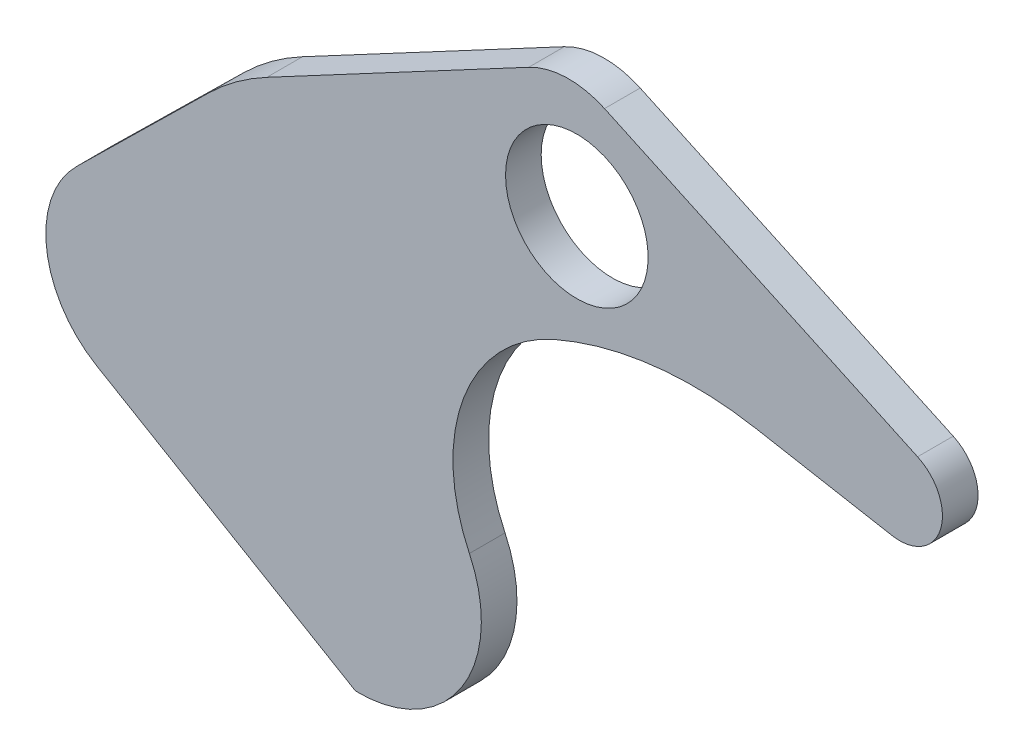
ISO-10303-21;
HEADER;
FILE_DESCRIPTION(('STEP AP214'),'2;1');
FILE_NAME('part.step','',(''),(''),'','','');
FILE_SCHEMA(('AUTOMOTIVE_DESIGN { 1 0 10303 214 1 1 1 1 }'));
ENDSEC;
DATA;
#1=APPLICATION_CONTEXT('core data for automotive mechanical design processes');
#2=APPLICATION_PROTOCOL_DEFINITION('international standard','automotive_design',2000,#1);
#3=PRODUCT_CONTEXT('',#1,'mechanical');
#4=PRODUCT('Part','Part','',(#3));
#5=PRODUCT_RELATED_PRODUCT_CATEGORY('part','',(#4));
#6=PRODUCT_DEFINITION_FORMATION('','',#4);
#7=PRODUCT_DEFINITION_CONTEXT('part definition',#1,'design');
#8=PRODUCT_DEFINITION('design','',#6,#7);
#9=PRODUCT_DEFINITION_SHAPE('','',#8);
#10=(LENGTH_UNIT() NAMED_UNIT(*) SI_UNIT(.MILLI.,.METRE.));
#11=(NAMED_UNIT(*) PLANE_ANGLE_UNIT() SI_UNIT($,.RADIAN.));
#12=(NAMED_UNIT(*) SI_UNIT($,.STERADIAN.) SOLID_ANGLE_UNIT());
#13=UNCERTAINTY_MEASURE_WITH_UNIT(LENGTH_MEASURE(1.E-05),#10,'distance_accuracy_value','');
#14=(GEOMETRIC_REPRESENTATION_CONTEXT(3) GLOBAL_UNCERTAINTY_ASSIGNED_CONTEXT((#13)) GLOBAL_UNIT_ASSIGNED_CONTEXT((#10,
#11,#12)) REPRESENTATION_CONTEXT('',''));
#15=CARTESIAN_POINT('',(0.,0.,0.));
#16=DIRECTION('',(0.,0.,1.));
#17=DIRECTION('',(1.,0.,0.));
#18=AXIS2_PLACEMENT_3D('',#15,#16,#17);
#19=CARTESIAN_POINT('',(-15.0507953187441,63.2742008184103,2.12075049396742));
#20=DIRECTION('',(0.,0.,1.));
#21=DIRECTION('',(1.,0.,0.));
#22=AXIS2_PLACEMENT_3D('',#19,#20,#21);
#23=PLANE('',#22);
#24=CARTESIAN_POINT('',(-15.0507953187441,63.2742008184103,2.12075049396742));
#25=DIRECTION('',(0.,0.,-1.));
#26=DIRECTION('',(-1.,0.,0.));
#27=AXIS2_PLACEMENT_3D('',#24,#25,#26);
#28=CIRCLE('',#27,0.244);
#29=CARTESIAN_POINT('',(-15.2947953187441,63.2742008184103,2.12075049396742));
#30=VERTEX_POINT('',#29);
#31=EDGE_CURVE('E40',#30,#30,#28,.F.);
#32=ORIENTED_EDGE('',*,*,#31,.F.);
#33=EDGE_LOOP('',(#32));
#34=FACE_BOUND('',#33,.T.);
#35=ADVANCED_FACE('F37',(#34),#23,.F.);
#36=CARTESIAN_POINT('',(-15.0507953187441,63.2742008184103,2.60875049396742));
#37=DIRECTION('',(0.,0.,-1.));
#38=DIRECTION('',(-1.,0.,0.));
#39=AXIS2_PLACEMENT_3D('',#36,#37,#38);
#40=CYLINDRICAL_SURFACE('',#39,0.244);
#41=CARTESIAN_POINT('',(-15.0507953187441,63.2742008184103,2.36475049396742));
#42=DIRECTION('',(0.,0.,-1.));
#43=DIRECTION('',(-1.,0.,0.));
#44=AXIS2_PLACEMENT_3D('',#41,#42,#43);
#45=CIRCLE('',#44,0.244);
#46=CARTESIAN_POINT('',(-15.2947953187441,63.2742008184103,2.36475049396742));
#47=VERTEX_POINT('',#46);
#48=EDGE_CURVE('E136',#47,#47,#45,.F.);
#49=ORIENTED_EDGE('',*,*,#48,.F.);
#50=EDGE_LOOP('',(#49));
#51=FACE_BOUND('',#50,.T.);
#52=ORIENTED_EDGE('',*,*,#31,.T.);
#53=EDGE_LOOP('',(#52));
#54=FACE_BOUND('',#53,.T.);
#55=ADVANCED_FACE('F215',(#51,#54),#40,.T.);
#56=CARTESIAN_POINT('',(-12.8619279288401,64.0390431083175,2.36475049396742));
#57=DIRECTION('',(0.,0.,-1.));
#58=DIRECTION('',(-1.,0.,0.));
#59=AXIS2_PLACEMENT_3D('',#56,#57,#58);
#60=PLANE('',#59);
#61=CARTESIAN_POINT('',(-12.1262589596433,65.1716124143208,2.36475049396742));
#62=DIRECTION('',(0.,0.,-1.));
#63=DIRECTION('',(-1.,0.,0.));
#64=AXIS2_PLACEMENT_3D('',#61,#62,#63);
#65=CIRCLE('',#64,0.488);
#66=CARTESIAN_POINT('',(-12.6142589596433,65.1716124143208,2.36475049396742));
#67=VERTEX_POINT('',#66);
#68=EDGE_CURVE('E152',#67,#67,#65,.F.);
#69=ORIENTED_EDGE('',*,*,#68,.T.);
#70=EDGE_LOOP('',(#69));
#71=FACE_BOUND('',#70,.T.);
#72=ORIENTED_EDGE('',*,*,#48,.T.);
#73=EDGE_LOOP('',(#72));
#74=FACE_BOUND('',#73,.T.);
#75=CARTESIAN_POINT('',(-13.4315915398064,63.4030464994757,2.36475049396742));
#76=DIRECTION('',(0.,0.,-1.));
#77=DIRECTION('',(-1.,0.,0.));
#78=AXIS2_PLACEMENT_3D('',#75,#76,#77);
#79=CIRCLE('',#78,1.73594301707969);
#80=CARTESIAN_POINT('',(-14.2483439210238,64.9348473045164,2.36475049396742));
#81=VERTEX_POINT('',#80);
#82=CARTESIAN_POINT('',(-14.6478616043926,64.641668834385,2.36475049396742));
#83=VERTEX_POINT('',#82);
#84=EDGE_CURVE('E192',#81,#83,#79,.F.);
#85=ORIENTED_EDGE('',*,*,#84,.F.);
#86=DIRECTION('',(-0.88240269984081,-0.470494925917006,0.));
#87=VECTOR('',#86,1.);
#88=CARTESIAN_POINT('',(-13.3520322219305,65.4127584742573,2.36475049396742));
#89=LINE('',#88,#87);
#90=CARTESIAN_POINT('',(-12.455720522838,65.8906696439978,2.36475049396742));
#91=VERTEX_POINT('',#90);
#92=EDGE_CURVE('E130',#91,#81,#89,.T.);
#93=ORIENTED_EDGE('',*,*,#92,.F.);
#94=CARTESIAN_POINT('',(-12.1816052253119,65.376572540542,2.36475049396742));
#95=DIRECTION('',(0.,0.,-1.));
#96=DIRECTION('',(-1.,0.,0.));
#97=AXIS2_PLACEMENT_3D('',#94,#95,#96);
#98=CIRCLE('',#97,0.582610528671788);
#99=CARTESIAN_POINT('',(-11.936749119351,65.905231708145,2.36475049396742));
#100=VERTEX_POINT('',#99);
#101=EDGE_CURVE('E125',#100,#91,#98,.F.);
#102=ORIENTED_EDGE('',*,*,#101,.F.);
#103=DIRECTION('',(-0.90739720892107,0.420274083476786,0.));
#104=VECTOR('',#103,1.);
#105=CARTESIAN_POINT('',(-10.8653298007544,65.4089884227177,2.36475049396742));
#106=LINE('',#105,#104);
#107=CARTESIAN_POINT('',(-9.79391048215854,64.9127451372913,2.36475049396742));
#108=VERTEX_POINT('',#107);
#109=EDGE_CURVE('E128',#108,#100,#106,.T.);
#110=ORIENTED_EDGE('',*,*,#109,.F.);
#111=CARTESIAN_POINT('',(-9.91708380029112,64.646806480873,2.36475049396742));
#112=DIRECTION('',(0.,0.,-1.));
#113=DIRECTION('',(-1.,0.,0.));
#114=AXIS2_PLACEMENT_3D('',#111,#112,#113);
#115=CIRCLE('',#114,0.293078547965612);
#116=CARTESIAN_POINT('',(-9.96933192152901,64.3584227623568,2.36475049396742));
#117=VERTEX_POINT('',#116);
#118=EDGE_CURVE('E208',#117,#108,#115,.F.);
#119=ORIENTED_EDGE('',*,*,#118,.F.);
#120=DIRECTION('',(0.983980985702214,-0.178273441029503,0.));
#121=VECTOR('',#120,1.);
#122=CARTESIAN_POINT('',(-10.4337456617578,64.4425632454911,2.36475049396742));
#123=LINE('',#122,#121);
#124=CARTESIAN_POINT('',(-10.8981594019869,64.5267037286257,2.36475049396742));
#125=VERTEX_POINT('',#124);
#126=EDGE_CURVE('E164',#125,#117,#123,.T.);
#127=ORIENTED_EDGE('',*,*,#126,.F.);
#128=CARTESIAN_POINT('',(-11.3238193734115,62.1772717782595,2.36475049396742));
#129=DIRECTION('',(0.,0.,-1.));
#130=DIRECTION('',(-1.,0.,0.));
#131=AXIS2_PLACEMENT_3D('',#128,#129,#130);
#132=CIRCLE('',#131,2.38768023417612);
#133=CARTESIAN_POINT('',(-12.2790428764785,64.3655507732399,2.36475049396742));
#134=VERTEX_POINT('',#133);
#135=EDGE_CURVE('E166',#125,#134,#132,.F.);
#136=ORIENTED_EDGE('',*,*,#135,.T.);
#137=CARTESIAN_POINT('',(-11.8154776697174,63.303589879793,2.36475049396742));
#138=DIRECTION('',(0.,0.,-1.));
#139=DIRECTION('',(-1.,0.,0.));
#140=AXIS2_PLACEMENT_3D('',#137,#138,#139);
#141=CIRCLE('',#140,1.15872932133866);
#142=CARTESIAN_POINT('',(-12.8617323430146,62.8055890778502,2.36475049396742));
#143=VERTEX_POINT('',#142);
#144=EDGE_CURVE('E201',#134,#143,#141,.F.);
#145=ORIENTED_EDGE('',*,*,#144,.T.);
#146=CARTESIAN_POINT('',(-13.6229069478519,62.4432819137325,2.36475049396742));
#147=DIRECTION('',(0.,0.,-1.));
#148=DIRECTION('',(-1.,0.,0.));
#149=AXIS2_PLACEMENT_3D('',#146,#147,#148);
#150=CIRCLE('',#149,0.84300252681718);
#151=CARTESIAN_POINT('',(-13.6408108311862,61.6004695317755,2.36475049396742));
#152=VERTEX_POINT('',#151);
#153=EDGE_CURVE('E198',#152,#143,#150,.F.);
#154=ORIENTED_EDGE('',*,*,#153,.F.);
#155=DIRECTION('',(0.861961217830752,-0.506974219221972,0.));
#156=VECTOR('',#155,1.);
#157=CARTESIAN_POINT('',(-14.5265855496448,62.1214499854289,2.36475049396742));
#158=LINE('',#157,#156);
#159=CARTESIAN_POINT('',(-15.4123602681031,62.6424304390819,2.36475049396742));
#160=VERTEX_POINT('',#159);
#161=EDGE_CURVE('E159',#160,#152,#158,.T.);
#162=ORIENTED_EDGE('',*,*,#161,.F.);
#163=CARTESIAN_POINT('',(-15.0538653298356,63.2519461143539,2.36475049396742));
#164=DIRECTION('',(0.,0.,-1.));
#165=DIRECTION('',(-1.,0.,0.));
#166=AXIS2_PLACEMENT_3D('',#163,#164,#165);
#167=CIRCLE('',#166,0.70712656516764);
#168=CARTESIAN_POINT('',(-15.5493060583763,63.7564919137302,2.36475049396742));
#169=VERTEX_POINT('',#168);
#170=EDGE_CURVE('E195',#169,#160,#167,.F.);
#171=ORIENTED_EDGE('',*,*,#170,.F.);
#172=DIRECTION('',(-0.713515549026206,-0.700639394623106,0.));
#173=VECTOR('',#172,1.);
#174=CARTESIAN_POINT('',(-15.0985838313841,64.1990803740573,2.36475049396742));
#175=LINE('',#174,#173);
#176=EDGE_CURVE('E154',#83,#169,#175,.T.);
#177=ORIENTED_EDGE('',*,*,#176,.F.);
#178=EDGE_LOOP('',(#85,#93,#102,#110,#119,#127,#136,#145,#154,#162,#171,#177));
#179=FACE_BOUND('',#178,.T.);
#180=ADVANCED_FACE('F127',(#71,#74,#179),#60,.T.);
#181=CARTESIAN_POINT('',(-12.1816052253119,65.376572540542,2.60875049396742));
#182=DIRECTION('',(0.,0.,-1.));
#183=DIRECTION('',(-1.,0.,0.));
#184=AXIS2_PLACEMENT_3D('',#181,#182,#183);
#185=CYLINDRICAL_SURFACE('',#184,0.582610528671788);
#186=DIRECTION('',(0.,0.,1.));
#187=VECTOR('',#186,1.);
#188=CARTESIAN_POINT('',(-11.9367491193507,65.9052317081448,2.60875049396742));
#189=LINE('',#188,#187);
#190=CARTESIAN_POINT('',(-11.9367491193511,65.9052317081452,2.60875049396742));
#191=VERTEX_POINT('',#190);
#192=EDGE_CURVE('E135',#100,#191,#189,.T.);
#193=ORIENTED_EDGE('',*,*,#192,.F.);
#194=ORIENTED_EDGE('',*,*,#101,.T.);
#195=DIRECTION('',(0.,0.,1.));
#196=VECTOR('',#195,1.);
#197=CARTESIAN_POINT('',(-12.455720522838,65.8906696439978,2.60875049396742));
#198=LINE('',#197,#196);
#199=CARTESIAN_POINT('',(-12.455720522838,65.8906696439975,2.60875049396742));
#200=VERTEX_POINT('',#199);
#201=EDGE_CURVE('E153',#200,#91,#198,.F.);
#202=ORIENTED_EDGE('',*,*,#201,.F.);
#203=CARTESIAN_POINT('',(-12.1816052253119,65.376572540542,2.60875049396742));
#204=DIRECTION('',(0.,0.,-1.));
#205=DIRECTION('',(-1.,0.,0.));
#206=AXIS2_PLACEMENT_3D('',#203,#204,#205);
#207=CIRCLE('',#206,0.582610528671788);
#208=EDGE_CURVE('E146',#200,#191,#207,.T.);
#209=ORIENTED_EDGE('',*,*,#208,.T.);
#210=EDGE_LOOP('',(#193,#194,#202,#209));
#211=FACE_BOUND('',#210,.T.);
#212=ADVANCED_FACE('F145',(#211),#185,.T.);
#213=CARTESIAN_POINT('',(-10.8653298007544,65.4089884227177,2.60875049396742));
#214=DIRECTION('',(0.420274083476786,0.90739720892107,0.));
#215=DIRECTION('',(-0.90739720892107,0.420274083476786,0.));
#216=AXIS2_PLACEMENT_3D('',#213,#214,#215);
#217=PLANE('',#216);
#218=DIRECTION('',(0.,0.,-1.));
#219=VECTOR('',#218,1.);
#220=CARTESIAN_POINT('',(-9.79391048215854,64.9127451372918,2.60875049396742));
#221=LINE('',#220,#219);
#222=CARTESIAN_POINT('',(-9.79391048215824,64.9127451372922,2.60875049396742));
#223=VERTEX_POINT('',#222);
#224=EDGE_CURVE('E142',#108,#223,#221,.F.);
#225=ORIENTED_EDGE('',*,*,#224,.F.);
#226=ORIENTED_EDGE('',*,*,#109,.T.);
#227=ORIENTED_EDGE('',*,*,#192,.T.);
#228=DIRECTION('',(0.90739720892133,-0.420274083476224,0.));
#229=VECTOR('',#228,1.);
#230=CARTESIAN_POINT('',(-11.9367491193506,65.9052317081452,2.60875049396742));
#231=LINE('',#230,#229);
#232=EDGE_CURVE('E188',#191,#223,#231,.T.);
#233=ORIENTED_EDGE('',*,*,#232,.T.);
#234=EDGE_LOOP('',(#225,#226,#227,#233));
#235=FACE_BOUND('',#234,.T.);
#236=ADVANCED_FACE('F139',(#235),#217,.T.);
#237=CARTESIAN_POINT('',(-9.91708380029112,64.646806480873,2.60875049396742));
#238=DIRECTION('',(0.,0.,-1.));
#239=DIRECTION('',(-1.,0.,0.));
#240=AXIS2_PLACEMENT_3D('',#237,#238,#239);
#241=CYLINDRICAL_SURFACE('',#240,0.293078547965612);
#242=DIRECTION('',(0.,0.,1.));
#243=VECTOR('',#242,1.);
#244=CARTESIAN_POINT('',(-9.96933192152898,64.3584227623567,2.60875049396742));
#245=LINE('',#244,#243);
#246=CARTESIAN_POINT('',(-9.96933192152913,64.3584227623571,2.60875049396742));
#247=VERTEX_POINT('',#246);
#248=EDGE_CURVE('E167',#117,#247,#245,.T.);
#249=ORIENTED_EDGE('',*,*,#248,.F.);
#250=ORIENTED_EDGE('',*,*,#118,.T.);
#251=ORIENTED_EDGE('',*,*,#224,.T.);
#252=CARTESIAN_POINT('',(-9.91708380029112,64.646806480873,2.60875049396742));
#253=DIRECTION('',(0.,0.,-1.));
#254=DIRECTION('',(-1.,0.,0.));
#255=AXIS2_PLACEMENT_3D('',#252,#253,#254);
#256=CIRCLE('',#255,0.293078547965612);
#257=EDGE_CURVE('E186',#223,#247,#256,.T.);
#258=ORIENTED_EDGE('',*,*,#257,.T.);
#259=EDGE_LOOP('',(#249,#250,#251,#258));
#260=FACE_BOUND('',#259,.T.);
#261=ADVANCED_FACE('F269',(#260),#241,.T.);
#262=CARTESIAN_POINT('',(-10.4337456617578,64.4425632454911,2.60875049396742));
#263=DIRECTION('',(-0.178273441029503,-0.983980985702214,0.));
#264=DIRECTION('',(0.983980985702214,-0.178273441029503,0.));
#265=AXIS2_PLACEMENT_3D('',#262,#263,#264);
#266=PLANE('',#265);
#267=DIRECTION('',(0.,0.,-1.));
#268=VECTOR('',#267,1.);
#269=CARTESIAN_POINT('',(-10.8981594019869,64.5267037286259,2.60875049396742));
#270=LINE('',#269,#268);
#271=CARTESIAN_POINT('',(-10.8981594019853,64.5267037286263,2.60875049396742));
#272=VERTEX_POINT('',#271);
#273=EDGE_CURVE('E205',#272,#125,#270,.T.);
#274=ORIENTED_EDGE('',*,*,#273,.T.);
#275=ORIENTED_EDGE('',*,*,#126,.T.);
#276=ORIENTED_EDGE('',*,*,#248,.T.);
#277=DIRECTION('',(-0.98398098570199,0.178273441030738,0.));
#278=VECTOR('',#277,1.);
#279=CARTESIAN_POINT('',(-9.96933192152887,64.3584227623573,2.60875049396742));
#280=LINE('',#279,#278);
#281=EDGE_CURVE('E185',#247,#272,#280,.T.);
#282=ORIENTED_EDGE('',*,*,#281,.T.);
#283=EDGE_LOOP('',(#274,#275,#276,#282));
#284=FACE_BOUND('',#283,.T.);
#285=ADVANCED_FACE('F265',(#284),#266,.T.);
#286=CARTESIAN_POINT('',(-11.3238193734115,62.1772717782595,2.60875049396742));
#287=DIRECTION('',(0.,0.,-1.));
#288=DIRECTION('',(-1.,0.,0.));
#289=AXIS2_PLACEMENT_3D('',#286,#287,#288);
#290=CYLINDRICAL_SURFACE('',#289,2.38768023417612);
#291=CARTESIAN_POINT('',(-11.3238193734115,62.1772717782595,2.60875049396742));
#292=DIRECTION('',(0.,0.,-1.));
#293=DIRECTION('',(-1.,0.,0.));
#294=AXIS2_PLACEMENT_3D('',#291,#292,#293);
#295=CIRCLE('',#294,2.38768023417612);
#296=CARTESIAN_POINT('',(-12.2790428764785,64.3655507732399,2.60875049396742));
#297=VERTEX_POINT('',#296);
#298=EDGE_CURVE('E182',#272,#297,#295,.F.);
#299=ORIENTED_EDGE('',*,*,#298,.T.);
#300=DIRECTION('',(0.,0.,-1.));
#301=VECTOR('',#300,1.);
#302=CARTESIAN_POINT('',(-12.279042876479,64.3655507732397,2.60875049396742));
#303=LINE('',#302,#301);
#304=EDGE_CURVE('E204',#297,#134,#303,.T.);
#305=ORIENTED_EDGE('',*,*,#304,.T.);
#306=ORIENTED_EDGE('',*,*,#135,.F.);
#307=ORIENTED_EDGE('',*,*,#273,.F.);
#308=EDGE_LOOP('',(#299,#305,#306,#307));
#309=FACE_BOUND('',#308,.T.);
#310=ADVANCED_FACE('F261',(#309),#290,.F.);
#311=CARTESIAN_POINT('',(-11.8154776697174,63.303589879793,2.60875049396742));
#312=DIRECTION('',(0.,0.,-1.));
#313=DIRECTION('',(-1.,0.,0.));
#314=AXIS2_PLACEMENT_3D('',#311,#312,#313);
#315=CYLINDRICAL_SURFACE('',#314,1.15872932133866);
#316=CARTESIAN_POINT('',(-11.8154776697174,63.303589879793,2.60875049396742));
#317=DIRECTION('',(0.,0.,-1.));
#318=DIRECTION('',(-1.,0.,0.));
#319=AXIS2_PLACEMENT_3D('',#316,#317,#318);
#320=CIRCLE('',#319,1.15872932133866);
#321=CARTESIAN_POINT('',(-12.8617323430146,62.8055890778502,2.60875049396742));
#322=VERTEX_POINT('',#321);
#323=EDGE_CURVE('E179',#297,#322,#320,.F.);
#324=ORIENTED_EDGE('',*,*,#323,.T.);
#325=DIRECTION('',(0.,0.,-1.));
#326=VECTOR('',#325,1.);
#327=CARTESIAN_POINT('',(-12.8617323430146,62.80558907785,2.60875049396742));
#328=LINE('',#327,#326);
#329=EDGE_CURVE('E200',#143,#322,#328,.F.);
#330=ORIENTED_EDGE('',*,*,#329,.F.);
#331=ORIENTED_EDGE('',*,*,#144,.F.);
#332=ORIENTED_EDGE('',*,*,#304,.F.);
#333=EDGE_LOOP('',(#324,#330,#331,#332));
#334=FACE_BOUND('',#333,.T.);
#335=ADVANCED_FACE('F257',(#334),#315,.F.);
#336=CARTESIAN_POINT('',(-13.6229069478519,62.4432819137325,2.60875049396742));
#337=DIRECTION('',(0.,0.,-1.));
#338=DIRECTION('',(-1.,0.,0.));
#339=AXIS2_PLACEMENT_3D('',#336,#337,#338);
#340=CYLINDRICAL_SURFACE('',#339,0.84300252681718);
#341=DIRECTION('',(0.,0.,1.));
#342=VECTOR('',#341,1.);
#343=CARTESIAN_POINT('',(-13.6408108311878,61.6004695317764,2.60875049396742));
#344=LINE('',#343,#342);
#345=CARTESIAN_POINT('',(-13.6408108311869,61.6004695317755,2.60875049396742));
#346=VERTEX_POINT('',#345);
#347=EDGE_CURVE('E163',#152,#346,#344,.T.);
#348=ORIENTED_EDGE('',*,*,#347,.F.);
#349=ORIENTED_EDGE('',*,*,#153,.T.);
#350=ORIENTED_EDGE('',*,*,#329,.T.);
#351=CARTESIAN_POINT('',(-13.6229069478519,62.4432819137325,2.60875049396742));
#352=DIRECTION('',(0.,0.,-1.));
#353=DIRECTION('',(-1.,0.,0.));
#354=AXIS2_PLACEMENT_3D('',#351,#352,#353);
#355=CIRCLE('',#354,0.84300252681718);
#356=EDGE_CURVE('E177',#322,#346,#355,.T.);
#357=ORIENTED_EDGE('',*,*,#356,.T.);
#358=EDGE_LOOP('',(#348,#349,#350,#357));
#359=FACE_BOUND('',#358,.T.);
#360=ADVANCED_FACE('F253',(#359),#340,.T.);
#361=CARTESIAN_POINT('',(-14.5265855496448,62.1214499854289,2.60875049396742));
#362=DIRECTION('',(-0.506974219221972,-0.861961217830752,0.));
#363=DIRECTION('',(0.861961217830752,-0.506974219221972,0.));
#364=AXIS2_PLACEMENT_3D('',#361,#362,#363);
#365=PLANE('',#364);
#366=DIRECTION('',(0.,0.,-1.));
#367=VECTOR('',#366,1.);
#368=CARTESIAN_POINT('',(-15.4123602681037,62.6424304390822,2.60875049396742));
#369=LINE('',#368,#367);
#370=CARTESIAN_POINT('',(-15.4123602681032,62.6424304390817,2.60875049396742));
#371=VERTEX_POINT('',#370);
#372=EDGE_CURVE('E162',#160,#371,#369,.F.);
#373=ORIENTED_EDGE('',*,*,#372,.F.);
#374=ORIENTED_EDGE('',*,*,#161,.T.);
#375=ORIENTED_EDGE('',*,*,#347,.T.);
#376=DIRECTION('',(-0.861961217830734,0.506974219222002,0.));
#377=VECTOR('',#376,1.);
#378=CARTESIAN_POINT('',(-13.6408108311881,61.6004695317758,2.60875049396742));
#379=LINE('',#378,#377);
#380=EDGE_CURVE('E176',#346,#371,#379,.T.);
#381=ORIENTED_EDGE('',*,*,#380,.T.);
#382=EDGE_LOOP('',(#373,#374,#375,#381));
#383=FACE_BOUND('',#382,.T.);
#384=ADVANCED_FACE('F249',(#383),#365,.T.);
#385=CARTESIAN_POINT('',(-15.0538653298356,63.2519461143539,2.60875049396742));
#386=DIRECTION('',(0.,0.,-1.));
#387=DIRECTION('',(-1.,0.,0.));
#388=AXIS2_PLACEMENT_3D('',#385,#386,#387);
#389=CYLINDRICAL_SURFACE('',#388,0.70712656516764);
#390=DIRECTION('',(0.,0.,1.));
#391=VECTOR('',#390,1.);
#392=CARTESIAN_POINT('',(-15.5493060583764,63.7564919137302,2.60875049396742));
#393=LINE('',#392,#391);
#394=CARTESIAN_POINT('',(-15.5493060583763,63.7564919137298,2.60875049396742));
#395=VERTEX_POINT('',#394);
#396=EDGE_CURVE('E158',#169,#395,#393,.T.);
#397=ORIENTED_EDGE('',*,*,#396,.F.);
#398=ORIENTED_EDGE('',*,*,#170,.T.);
#399=ORIENTED_EDGE('',*,*,#372,.T.);
#400=CARTESIAN_POINT('',(-15.0538653298356,63.2519461143539,2.60875049396742));
#401=DIRECTION('',(0.,0.,-1.));
#402=DIRECTION('',(-1.,0.,0.));
#403=AXIS2_PLACEMENT_3D('',#400,#401,#402);
#404=CIRCLE('',#403,0.70712656516764);
#405=EDGE_CURVE('E173',#371,#395,#404,.T.);
#406=ORIENTED_EDGE('',*,*,#405,.T.);
#407=EDGE_LOOP('',(#397,#398,#399,#406));
#408=FACE_BOUND('',#407,.T.);
#409=ADVANCED_FACE('F245',(#408),#389,.T.);
#410=CARTESIAN_POINT('',(-15.0985838313841,64.1990803740573,2.60875049396742));
#411=DIRECTION('',(-0.700639394623106,0.713515549026206,0.));
#412=DIRECTION('',(-0.713515549026206,-0.700639394623106,0.));
#413=AXIS2_PLACEMENT_3D('',#410,#411,#412);
#414=PLANE('',#413);
#415=DIRECTION('',(0.,0.,-1.));
#416=VECTOR('',#415,1.);
#417=CARTESIAN_POINT('',(-14.6478616043931,64.6416688343858,2.60875049396742));
#418=LINE('',#417,#416);
#419=CARTESIAN_POINT('',(-14.6478616043933,64.6416688343847,2.60875049396742));
#420=VERTEX_POINT('',#419);
#421=EDGE_CURVE('E157',#83,#420,#418,.F.);
#422=ORIENTED_EDGE('',*,*,#421,.F.);
#423=ORIENTED_EDGE('',*,*,#176,.T.);
#424=ORIENTED_EDGE('',*,*,#396,.T.);
#425=DIRECTION('',(0.713515549025635,0.700639394623687,0.));
#426=VECTOR('',#425,1.);
#427=CARTESIAN_POINT('',(-15.549306058376,63.7564919137298,2.60875049396742));
#428=LINE('',#427,#426);
#429=EDGE_CURVE('E172',#395,#420,#428,.T.);
#430=ORIENTED_EDGE('',*,*,#429,.T.);
#431=EDGE_LOOP('',(#422,#423,#424,#430));
#432=FACE_BOUND('',#431,.T.);
#433=ADVANCED_FACE('F241',(#432),#414,.T.);
#434=CARTESIAN_POINT('',(-13.4315915398064,63.4030464994757,2.60875049396742));
#435=DIRECTION('',(0.,0.,-1.));
#436=DIRECTION('',(-1.,0.,0.));
#437=AXIS2_PLACEMENT_3D('',#434,#435,#436);
#438=CYLINDRICAL_SURFACE('',#437,1.73594301707969);
#439=DIRECTION('',(0.,0.,1.));
#440=VECTOR('',#439,1.);
#441=CARTESIAN_POINT('',(-14.2483439210242,64.9348473045162,2.60875049396742));
#442=LINE('',#441,#440);
#443=CARTESIAN_POINT('',(-14.2483439210239,64.9348473045155,2.60875049396742));
#444=VERTEX_POINT('',#443);
#445=EDGE_CURVE('E55',#81,#444,#442,.T.);
#446=ORIENTED_EDGE('',*,*,#445,.F.);
#447=ORIENTED_EDGE('',*,*,#84,.T.);
#448=ORIENTED_EDGE('',*,*,#421,.T.);
#449=CARTESIAN_POINT('',(-13.4315915398064,63.4030464994757,2.60875049396742));
#450=DIRECTION('',(0.,0.,-1.));
#451=DIRECTION('',(-1.,0.,0.));
#452=AXIS2_PLACEMENT_3D('',#449,#450,#451);
#453=CIRCLE('',#452,1.73594301707969);
#454=EDGE_CURVE('E169',#420,#444,#453,.T.);
#455=ORIENTED_EDGE('',*,*,#454,.T.);
#456=EDGE_LOOP('',(#446,#447,#448,#455));
#457=FACE_BOUND('',#456,.T.);
#458=ADVANCED_FACE('F238',(#457),#438,.T.);
#459=CARTESIAN_POINT('',(-13.3520322219305,65.4127584742573,2.60875049396742));
#460=DIRECTION('',(-0.470494925917006,0.88240269984081,0.));
#461=DIRECTION('',(-0.88240269984081,-0.470494925917006,0.));
#462=AXIS2_PLACEMENT_3D('',#459,#460,#461);
#463=PLANE('',#462);
#464=ORIENTED_EDGE('',*,*,#201,.T.);
#465=ORIENTED_EDGE('',*,*,#92,.T.);
#466=ORIENTED_EDGE('',*,*,#445,.T.);
#467=DIRECTION('',(0.882402699840578,0.470494925917441,0.));
#468=VECTOR('',#467,1.);
#469=CARTESIAN_POINT('',(-14.2483439210235,64.9348473045149,2.60875049396742));
#470=LINE('',#469,#468);
#471=EDGE_CURVE('E46',#444,#200,#470,.T.);
#472=ORIENTED_EDGE('',*,*,#471,.T.);
#473=EDGE_LOOP('',(#464,#465,#466,#472));
#474=FACE_BOUND('',#473,.T.);
#475=ADVANCED_FACE('F230',(#474),#463,.T.);
#476=CARTESIAN_POINT('',(-12.1262589596433,65.1716124143208,2.60875049396742));
#477=DIRECTION('',(0.,0.,-1.));
#478=DIRECTION('',(-1.,0.,0.));
#479=AXIS2_PLACEMENT_3D('',#476,#477,#478);
#480=CYLINDRICAL_SURFACE('',#479,0.488);
#481=CARTESIAN_POINT('',(-12.1262589596433,65.1716124143208,2.60875049396742));
#482=DIRECTION('',(0.,0.,-1.));
#483=DIRECTION('',(-1.,0.,0.));
#484=AXIS2_PLACEMENT_3D('',#481,#482,#483);
#485=CIRCLE('',#484,0.488);
#486=CARTESIAN_POINT('',(-12.6142589596433,65.1716124143208,2.60875049396742));
#487=VERTEX_POINT('',#486);
#488=EDGE_CURVE('E11',#487,#487,#485,.F.);
#489=ORIENTED_EDGE('',*,*,#488,.T.);
#490=EDGE_LOOP('',(#489));
#491=FACE_BOUND('',#490,.T.);
#492=ORIENTED_EDGE('',*,*,#68,.F.);
#493=EDGE_LOOP('',(#492));
#494=FACE_BOUND('',#493,.T.);
#495=ADVANCED_FACE('F224',(#491,#494),#480,.F.);
#496=CARTESIAN_POINT('',(-12.8619279288401,64.0390431083175,2.60875049396742));
#497=DIRECTION('',(0.,0.,-1.));
#498=DIRECTION('',(-1.,0.,0.));
#499=AXIS2_PLACEMENT_3D('',#496,#497,#498);
#500=PLANE('',#499);
#501=ORIENTED_EDGE('',*,*,#488,.F.);
#502=EDGE_LOOP('',(#501));
#503=FACE_BOUND('',#502,.T.);
#504=ORIENTED_EDGE('',*,*,#454,.F.);
#505=ORIENTED_EDGE('',*,*,#429,.F.);
#506=ORIENTED_EDGE('',*,*,#405,.F.);
#507=ORIENTED_EDGE('',*,*,#380,.F.);
#508=ORIENTED_EDGE('',*,*,#356,.F.);
#509=ORIENTED_EDGE('',*,*,#323,.F.);
#510=ORIENTED_EDGE('',*,*,#298,.F.);
#511=ORIENTED_EDGE('',*,*,#281,.F.);
#512=ORIENTED_EDGE('',*,*,#257,.F.);
#513=ORIENTED_EDGE('',*,*,#232,.F.);
#514=ORIENTED_EDGE('',*,*,#208,.F.);
#515=ORIENTED_EDGE('',*,*,#471,.F.);
#516=EDGE_LOOP('',(#504,#505,#506,#507,#508,#509,#510,#511,#512,#513,#514,#515));
#517=FACE_BOUND('',#516,.T.);
#518=ADVANCED_FACE('F222',(#503,#517),#500,.F.);
#519=CLOSED_SHELL('',(#35,#55,#180,#212,#236,#261,#285,#310,#335,#360,#384,#409,#433,#458,#475,
#495,#518));
#520=MANIFOLD_SOLID_BREP('B2',#519);
#521=ADVANCED_BREP_SHAPE_REPRESENTATION('',(#18,#520),#14);
#522=SHAPE_DEFINITION_REPRESENTATION(#9,#521);
ENDSEC;
END-ISO-10303-21;
